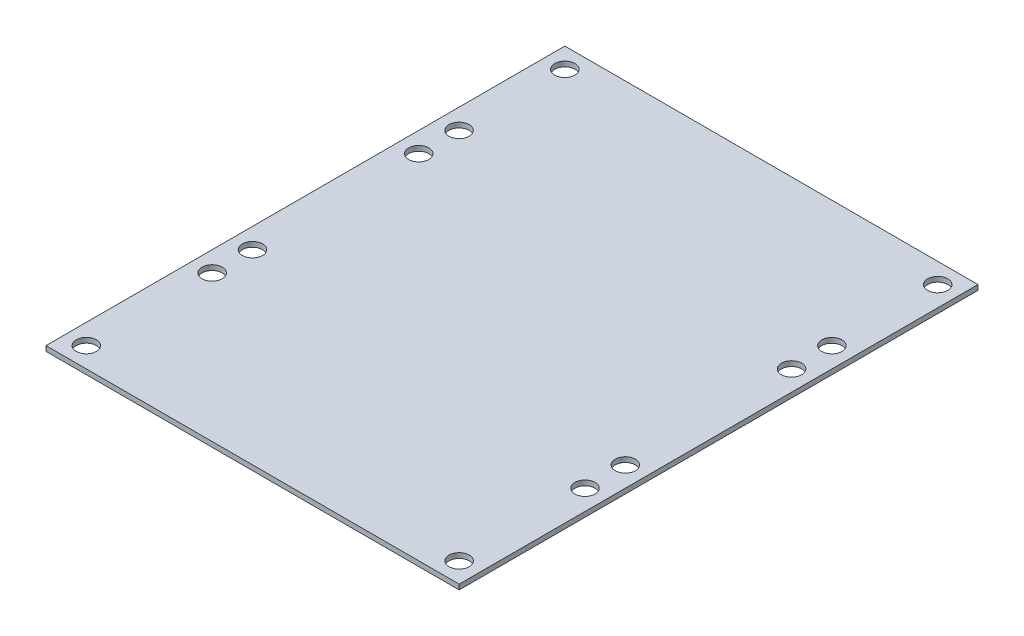
ISO-10303-21;
HEADER;
FILE_DESCRIPTION(('STEP AP214'),'2;1');
FILE_NAME('part.step','',(''),(''),'','','');
FILE_SCHEMA(('AUTOMOTIVE_DESIGN { 1 0 10303 214 1 1 1 1 }'));
ENDSEC;
DATA;
#1=APPLICATION_CONTEXT('core data for automotive mechanical design processes');
#2=APPLICATION_PROTOCOL_DEFINITION('international standard','automotive_design',2000,#1);
#3=PRODUCT_CONTEXT('',#1,'mechanical');
#4=PRODUCT('Part','Part','',(#3));
#5=PRODUCT_RELATED_PRODUCT_CATEGORY('part','',(#4));
#6=PRODUCT_DEFINITION_FORMATION('','',#4);
#7=PRODUCT_DEFINITION_CONTEXT('part definition',#1,'design');
#8=PRODUCT_DEFINITION('design','',#6,#7);
#9=PRODUCT_DEFINITION_SHAPE('','',#8);
#10=(LENGTH_UNIT() NAMED_UNIT(*) SI_UNIT(.MILLI.,.METRE.));
#11=(NAMED_UNIT(*) PLANE_ANGLE_UNIT() SI_UNIT($,.RADIAN.));
#12=(NAMED_UNIT(*) SI_UNIT($,.STERADIAN.) SOLID_ANGLE_UNIT());
#13=UNCERTAINTY_MEASURE_WITH_UNIT(LENGTH_MEASURE(1.E-05),#10,'distance_accuracy_value','');
#14=(GEOMETRIC_REPRESENTATION_CONTEXT(3) GLOBAL_UNCERTAINTY_ASSIGNED_CONTEXT((#13)) GLOBAL_UNIT_ASSIGNED_CONTEXT((#10,
#11,#12)) REPRESENTATION_CONTEXT('',''));
#15=CARTESIAN_POINT('',(0.,0.,0.));
#16=DIRECTION('',(0.,0.,1.));
#17=DIRECTION('',(1.,0.,0.));
#18=AXIS2_PLACEMENT_3D('',#15,#16,#17);
#19=CARTESIAN_POINT('',(0.,1.5875,0.));
#20=DIRECTION('',(0.,-1.,0.));
#21=DIRECTION('',(0.,0.,-1.));
#22=AXIS2_PLACEMENT_3D('',#19,#20,#21);
#23=PLANE('',#22);
#24=DIRECTION('',(0.,0.,1.));
#25=VECTOR('',#24,1.);
#26=CARTESIAN_POINT('',(0.,1.5875,0.));
#27=LINE('',#26,#25);
#28=CARTESIAN_POINT('',(0.,1.5875,-163.4744));
#29=VERTEX_POINT('',#28);
#30=CARTESIAN_POINT('',(0.,1.5875,0.));
#31=VERTEX_POINT('',#30);
#32=EDGE_CURVE('E92',#29,#31,#27,.T.);
#33=ORIENTED_EDGE('',*,*,#32,.T.);
#34=DIRECTION('',(1.,0.,0.));
#35=VECTOR('',#34,1.);
#36=CARTESIAN_POINT('',(0.,1.5875,0.));
#37=LINE('',#36,#35);
#38=CARTESIAN_POINT('',(130.175,1.5875,0.));
#39=VERTEX_POINT('',#38);
#40=EDGE_CURVE('E87',#31,#39,#37,.T.);
#41=ORIENTED_EDGE('',*,*,#40,.T.);
#42=DIRECTION('',(0.,0.,-1.));
#43=VECTOR('',#42,1.);
#44=CARTESIAN_POINT('',(130.175,1.5875,0.));
#45=LINE('',#44,#43);
#46=CARTESIAN_POINT('',(130.175,1.5875,-163.4744));
#47=VERTEX_POINT('',#46);
#48=EDGE_CURVE('E90',#39,#47,#45,.T.);
#49=ORIENTED_EDGE('',*,*,#48,.T.);
#50=DIRECTION('',(-1.,0.,0.));
#51=VECTOR('',#50,1.);
#52=CARTESIAN_POINT('',(0.,1.5875,-163.4744));
#53=LINE('',#52,#51);
#54=EDGE_CURVE('E57',#47,#29,#53,.T.);
#55=ORIENTED_EDGE('',*,*,#54,.T.);
#56=EDGE_LOOP('',(#33,#41,#49,#55));
#57=FACE_BOUND('',#56,.T.);
#58=CARTESIAN_POINT('',(6.35,1.5875,-6.35));
#59=DIRECTION('',(0.,1.,0.));
#60=DIRECTION('',(0.,0.,1.));
#61=AXIS2_PLACEMENT_3D('',#58,#59,#60);
#62=CIRCLE('',#61,3.175);
#63=CARTESIAN_POINT('',(6.35,1.5875,-3.175));
#64=VERTEX_POINT('',#63);
#65=EDGE_CURVE('E112',#64,#64,#62,.T.);
#66=ORIENTED_EDGE('',*,*,#65,.F.);
#67=EDGE_LOOP('',(#66));
#68=FACE_BOUND('',#67,.T.);
#69=CARTESIAN_POINT('',(6.35,1.5875,-157.1244));
#70=DIRECTION('',(0.,1.,0.));
#71=DIRECTION('',(0.,0.,1.));
#72=AXIS2_PLACEMENT_3D('',#69,#70,#71);
#73=CIRCLE('',#72,3.175);
#74=CARTESIAN_POINT('',(6.35,1.5875,-153.9494));
#75=VERTEX_POINT('',#74);
#76=EDGE_CURVE('E134',#75,#75,#73,.T.);
#77=ORIENTED_EDGE('',*,*,#76,.F.);
#78=EDGE_LOOP('',(#77));
#79=FACE_BOUND('',#78,.T.);
#80=CARTESIAN_POINT('',(6.35,1.5875,-123.7869));
#81=DIRECTION('',(0.,1.,0.));
#82=DIRECTION('',(0.,0.,1.));
#83=AXIS2_PLACEMENT_3D('',#80,#81,#82);
#84=CIRCLE('',#83,3.175);
#85=CARTESIAN_POINT('',(6.35,1.5875,-120.6119));
#86=VERTEX_POINT('',#85);
#87=EDGE_CURVE('E142',#86,#86,#84,.T.);
#88=ORIENTED_EDGE('',*,*,#87,.F.);
#89=EDGE_LOOP('',(#88));
#90=FACE_BOUND('',#89,.T.);
#91=CARTESIAN_POINT('',(123.825,1.5875,-6.35));
#92=DIRECTION('',(0.,1.,0.));
#93=DIRECTION('',(0.,0.,-1.));
#94=AXIS2_PLACEMENT_3D('',#91,#92,#93);
#95=CIRCLE('',#94,3.17499999999998);
#96=CARTESIAN_POINT('',(123.825,1.5875,-9.52499999999998));
#97=VERTEX_POINT('',#96);
#98=EDGE_CURVE('E150',#97,#97,#95,.T.);
#99=ORIENTED_EDGE('',*,*,#98,.F.);
#100=EDGE_LOOP('',(#99));
#101=FACE_BOUND('',#100,.T.);
#102=CARTESIAN_POINT('',(123.825,1.5875,-123.7869));
#103=DIRECTION('',(0.,1.,0.));
#104=DIRECTION('',(0.,0.,-1.));
#105=AXIS2_PLACEMENT_3D('',#102,#103,#104);
#106=CIRCLE('',#105,3.17500000000001);
#107=CARTESIAN_POINT('',(123.825,1.5875,-126.9619));
#108=VERTEX_POINT('',#107);
#109=EDGE_CURVE('E158',#108,#108,#106,.T.);
#110=ORIENTED_EDGE('',*,*,#109,.F.);
#111=EDGE_LOOP('',(#110));
#112=FACE_BOUND('',#111,.T.);
#113=CARTESIAN_POINT('',(6.35000000000001,1.5875,-111.0869));
#114=DIRECTION('',(0.,1.,0.));
#115=DIRECTION('',(0.,0.,1.));
#116=AXIS2_PLACEMENT_3D('',#113,#114,#115);
#117=CIRCLE('',#116,3.175);
#118=CARTESIAN_POINT('',(6.35000000000001,1.5875,-107.9119));
#119=VERTEX_POINT('',#118);
#120=EDGE_CURVE('E166',#119,#119,#117,.T.);
#121=ORIENTED_EDGE('',*,*,#120,.F.);
#122=EDGE_LOOP('',(#121));
#123=FACE_BOUND('',#122,.T.);
#124=CARTESIAN_POINT('',(123.825,1.5875,-157.1244));
#125=DIRECTION('',(0.,1.,0.));
#126=DIRECTION('',(0.,0.,-1.));
#127=AXIS2_PLACEMENT_3D('',#124,#125,#126);
#128=CIRCLE('',#127,3.17499999999998);
#129=CARTESIAN_POINT('',(123.825,1.5875,-160.2994));
#130=VERTEX_POINT('',#129);
#131=EDGE_CURVE('E174',#130,#130,#128,.T.);
#132=ORIENTED_EDGE('',*,*,#131,.F.);
#133=EDGE_LOOP('',(#132));
#134=FACE_BOUND('',#133,.T.);
#135=CARTESIAN_POINT('',(6.35000000000001,1.5875,-58.6994));
#136=DIRECTION('',(0.,1.,0.));
#137=DIRECTION('',(0.,0.,1.));
#138=AXIS2_PLACEMENT_3D('',#135,#136,#137);
#139=CIRCLE('',#138,3.175);
#140=CARTESIAN_POINT('',(6.35000000000001,1.5875,-55.5244));
#141=VERTEX_POINT('',#140);
#142=EDGE_CURVE('E182',#141,#141,#139,.T.);
#143=ORIENTED_EDGE('',*,*,#142,.F.);
#144=EDGE_LOOP('',(#143));
#145=FACE_BOUND('',#144,.T.);
#146=CARTESIAN_POINT('',(6.35000000000001,1.5875,-45.9994));
#147=DIRECTION('',(0.,1.,0.));
#148=DIRECTION('',(0.,0.,1.));
#149=AXIS2_PLACEMENT_3D('',#146,#147,#148);
#150=CIRCLE('',#149,3.175);
#151=CARTESIAN_POINT('',(6.35000000000001,1.5875,-42.8244));
#152=VERTEX_POINT('',#151);
#153=EDGE_CURVE('E190',#152,#152,#150,.T.);
#154=ORIENTED_EDGE('',*,*,#153,.F.);
#155=EDGE_LOOP('',(#154));
#156=FACE_BOUND('',#155,.T.);
#157=CARTESIAN_POINT('',(123.825,1.5875,-111.0869));
#158=DIRECTION('',(0.,1.,0.));
#159=DIRECTION('',(0.,0.,-1.));
#160=AXIS2_PLACEMENT_3D('',#157,#158,#159);
#161=CIRCLE('',#160,3.175);
#162=CARTESIAN_POINT('',(123.825,1.5875,-114.2619));
#163=VERTEX_POINT('',#162);
#164=EDGE_CURVE('E198',#163,#163,#161,.T.);
#165=ORIENTED_EDGE('',*,*,#164,.F.);
#166=EDGE_LOOP('',(#165));
#167=FACE_BOUND('',#166,.T.);
#168=CARTESIAN_POINT('',(123.825,1.5875,-58.6994));
#169=DIRECTION('',(0.,1.,0.));
#170=DIRECTION('',(0.,0.,-1.));
#171=AXIS2_PLACEMENT_3D('',#168,#169,#170);
#172=CIRCLE('',#171,3.175);
#173=CARTESIAN_POINT('',(123.825,1.5875,-61.8744));
#174=VERTEX_POINT('',#173);
#175=EDGE_CURVE('E206',#174,#174,#172,.T.);
#176=ORIENTED_EDGE('',*,*,#175,.F.);
#177=EDGE_LOOP('',(#176));
#178=FACE_BOUND('',#177,.T.);
#179=CARTESIAN_POINT('',(123.825,1.5875,-45.9994));
#180=DIRECTION('',(0.,1.,0.));
#181=DIRECTION('',(0.,0.,-1.));
#182=AXIS2_PLACEMENT_3D('',#179,#180,#181);
#183=CIRCLE('',#182,3.175);
#184=CARTESIAN_POINT('',(123.825,1.5875,-49.1744));
#185=VERTEX_POINT('',#184);
#186=EDGE_CURVE('E214',#185,#185,#183,.T.);
#187=ORIENTED_EDGE('',*,*,#186,.F.);
#188=EDGE_LOOP('',(#187));
#189=FACE_BOUND('',#188,.T.);
#190=ADVANCED_FACE('F39',(#57,#68,#79,#90,#101,#112,#123,#134,#145,#156,#167,#178,#189),#23,.F.);
#191=CARTESIAN_POINT('',(0.,0.,0.));
#192=DIRECTION('',(0.,-1.,0.));
#193=DIRECTION('',(0.,0.,-1.));
#194=AXIS2_PLACEMENT_3D('',#191,#192,#193);
#195=PLANE('',#194);
#196=CARTESIAN_POINT('',(123.825,0.,-58.6994));
#197=DIRECTION('',(0.,1.,0.));
#198=DIRECTION('',(0.,0.,-1.));
#199=AXIS2_PLACEMENT_3D('',#196,#197,#198);
#200=CIRCLE('',#199,3.175);
#201=CARTESIAN_POINT('',(123.825,0.,-61.8744));
#202=VERTEX_POINT('',#201);
#203=EDGE_CURVE('E210',#202,#202,#200,.T.);
#204=ORIENTED_EDGE('',*,*,#203,.T.);
#205=EDGE_LOOP('',(#204));
#206=FACE_BOUND('',#205,.T.);
#207=CARTESIAN_POINT('',(6.35000000000001,0.,-45.9994));
#208=DIRECTION('',(0.,1.,0.));
#209=DIRECTION('',(0.,0.,1.));
#210=AXIS2_PLACEMENT_3D('',#207,#208,#209);
#211=CIRCLE('',#210,3.175);
#212=CARTESIAN_POINT('',(6.35000000000001,0.,-42.8244));
#213=VERTEX_POINT('',#212);
#214=EDGE_CURVE('E194',#213,#213,#211,.T.);
#215=ORIENTED_EDGE('',*,*,#214,.T.);
#216=EDGE_LOOP('',(#215));
#217=FACE_BOUND('',#216,.T.);
#218=CARTESIAN_POINT('',(123.825,0.,-157.1244));
#219=DIRECTION('',(0.,1.,0.));
#220=DIRECTION('',(0.,0.,-1.));
#221=AXIS2_PLACEMENT_3D('',#218,#219,#220);
#222=CIRCLE('',#221,3.17499999999998);
#223=CARTESIAN_POINT('',(123.825,0.,-160.2994));
#224=VERTEX_POINT('',#223);
#225=EDGE_CURVE('E178',#224,#224,#222,.T.);
#226=ORIENTED_EDGE('',*,*,#225,.T.);
#227=EDGE_LOOP('',(#226));
#228=FACE_BOUND('',#227,.T.);
#229=CARTESIAN_POINT('',(123.825,0.,-123.7869));
#230=DIRECTION('',(0.,1.,0.));
#231=DIRECTION('',(0.,0.,-1.));
#232=AXIS2_PLACEMENT_3D('',#229,#230,#231);
#233=CIRCLE('',#232,3.17500000000001);
#234=CARTESIAN_POINT('',(123.825,0.,-126.9619));
#235=VERTEX_POINT('',#234);
#236=EDGE_CURVE('E162',#235,#235,#233,.T.);
#237=ORIENTED_EDGE('',*,*,#236,.T.);
#238=EDGE_LOOP('',(#237));
#239=FACE_BOUND('',#238,.T.);
#240=CARTESIAN_POINT('',(6.35,0.,-123.7869));
#241=DIRECTION('',(0.,1.,0.));
#242=DIRECTION('',(0.,0.,1.));
#243=AXIS2_PLACEMENT_3D('',#240,#241,#242);
#244=CIRCLE('',#243,3.175);
#245=CARTESIAN_POINT('',(6.35,0.,-120.6119));
#246=VERTEX_POINT('',#245);
#247=EDGE_CURVE('E146',#246,#246,#244,.T.);
#248=ORIENTED_EDGE('',*,*,#247,.T.);
#249=EDGE_LOOP('',(#248));
#250=FACE_BOUND('',#249,.T.);
#251=CARTESIAN_POINT('',(6.35,0.,-6.35));
#252=DIRECTION('',(0.,1.,0.));
#253=DIRECTION('',(0.,0.,1.));
#254=AXIS2_PLACEMENT_3D('',#251,#252,#253);
#255=CIRCLE('',#254,3.175);
#256=CARTESIAN_POINT('',(6.35,0.,-3.175));
#257=VERTEX_POINT('',#256);
#258=EDGE_CURVE('E130',#257,#257,#255,.T.);
#259=ORIENTED_EDGE('',*,*,#258,.T.);
#260=EDGE_LOOP('',(#259));
#261=FACE_BOUND('',#260,.T.);
#262=DIRECTION('',(0.,0.,1.));
#263=VECTOR('',#262,1.);
#264=CARTESIAN_POINT('',(0.,0.,0.));
#265=LINE('',#264,#263);
#266=CARTESIAN_POINT('',(0.,0.,-163.4744));
#267=VERTEX_POINT('',#266);
#268=CARTESIAN_POINT('',(0.,0.,0.));
#269=VERTEX_POINT('',#268);
#270=EDGE_CURVE('E108',#267,#269,#265,.T.);
#271=ORIENTED_EDGE('',*,*,#270,.F.);
#272=DIRECTION('',(-1.,0.,0.));
#273=VECTOR('',#272,1.);
#274=CARTESIAN_POINT('',(0.,0.,-163.4744));
#275=LINE('',#274,#273);
#276=CARTESIAN_POINT('',(130.175,0.,-163.4744));
#277=VERTEX_POINT('',#276);
#278=EDGE_CURVE('E80',#277,#267,#275,.T.);
#279=ORIENTED_EDGE('',*,*,#278,.F.);
#280=DIRECTION('',(0.,0.,-1.));
#281=VECTOR('',#280,1.);
#282=CARTESIAN_POINT('',(130.175,0.,0.));
#283=LINE('',#282,#281);
#284=CARTESIAN_POINT('',(130.175,0.,0.));
#285=VERTEX_POINT('',#284);
#286=EDGE_CURVE('E74',#285,#277,#283,.T.);
#287=ORIENTED_EDGE('',*,*,#286,.F.);
#288=DIRECTION('',(1.,0.,0.));
#289=VECTOR('',#288,1.);
#290=CARTESIAN_POINT('',(0.,0.,0.));
#291=LINE('',#290,#289);
#292=EDGE_CURVE('E97',#269,#285,#291,.T.);
#293=ORIENTED_EDGE('',*,*,#292,.F.);
#294=EDGE_LOOP('',(#271,#279,#287,#293));
#295=FACE_BOUND('',#294,.T.);
#296=CARTESIAN_POINT('',(6.35,0.,-157.1244));
#297=DIRECTION('',(0.,1.,0.));
#298=DIRECTION('',(0.,0.,1.));
#299=AXIS2_PLACEMENT_3D('',#296,#297,#298);
#300=CIRCLE('',#299,3.175);
#301=CARTESIAN_POINT('',(6.35,0.,-153.9494));
#302=VERTEX_POINT('',#301);
#303=EDGE_CURVE('E138',#302,#302,#300,.T.);
#304=ORIENTED_EDGE('',*,*,#303,.T.);
#305=EDGE_LOOP('',(#304));
#306=FACE_BOUND('',#305,.T.);
#307=CARTESIAN_POINT('',(123.825,0.,-6.35));
#308=DIRECTION('',(0.,1.,0.));
#309=DIRECTION('',(0.,0.,-1.));
#310=AXIS2_PLACEMENT_3D('',#307,#308,#309);
#311=CIRCLE('',#310,3.17499999999998);
#312=CARTESIAN_POINT('',(123.825,0.,-9.52499999999998));
#313=VERTEX_POINT('',#312);
#314=EDGE_CURVE('E154',#313,#313,#311,.T.);
#315=ORIENTED_EDGE('',*,*,#314,.T.);
#316=EDGE_LOOP('',(#315));
#317=FACE_BOUND('',#316,.T.);
#318=CARTESIAN_POINT('',(6.35000000000001,0.,-111.0869));
#319=DIRECTION('',(0.,1.,0.));
#320=DIRECTION('',(0.,0.,1.));
#321=AXIS2_PLACEMENT_3D('',#318,#319,#320);
#322=CIRCLE('',#321,3.175);
#323=CARTESIAN_POINT('',(6.35000000000001,0.,-107.9119));
#324=VERTEX_POINT('',#323);
#325=EDGE_CURVE('E170',#324,#324,#322,.T.);
#326=ORIENTED_EDGE('',*,*,#325,.T.);
#327=EDGE_LOOP('',(#326));
#328=FACE_BOUND('',#327,.T.);
#329=CARTESIAN_POINT('',(6.35000000000001,0.,-58.6994));
#330=DIRECTION('',(0.,1.,0.));
#331=DIRECTION('',(0.,0.,1.));
#332=AXIS2_PLACEMENT_3D('',#329,#330,#331);
#333=CIRCLE('',#332,3.175);
#334=CARTESIAN_POINT('',(6.35000000000001,0.,-55.5244));
#335=VERTEX_POINT('',#334);
#336=EDGE_CURVE('E186',#335,#335,#333,.T.);
#337=ORIENTED_EDGE('',*,*,#336,.T.);
#338=EDGE_LOOP('',(#337));
#339=FACE_BOUND('',#338,.T.);
#340=CARTESIAN_POINT('',(123.825,0.,-111.0869));
#341=DIRECTION('',(0.,1.,0.));
#342=DIRECTION('',(0.,0.,-1.));
#343=AXIS2_PLACEMENT_3D('',#340,#341,#342);
#344=CIRCLE('',#343,3.175);
#345=CARTESIAN_POINT('',(123.825,0.,-114.2619));
#346=VERTEX_POINT('',#345);
#347=EDGE_CURVE('E202',#346,#346,#344,.T.);
#348=ORIENTED_EDGE('',*,*,#347,.T.);
#349=EDGE_LOOP('',(#348));
#350=FACE_BOUND('',#349,.T.);
#351=CARTESIAN_POINT('',(123.825,0.,-45.9994));
#352=DIRECTION('',(0.,1.,0.));
#353=DIRECTION('',(0.,0.,-1.));
#354=AXIS2_PLACEMENT_3D('',#351,#352,#353);
#355=CIRCLE('',#354,3.175);
#356=CARTESIAN_POINT('',(123.825,0.,-49.1744));
#357=VERTEX_POINT('',#356);
#358=EDGE_CURVE('E218',#357,#357,#355,.T.);
#359=ORIENTED_EDGE('',*,*,#358,.T.);
#360=EDGE_LOOP('',(#359));
#361=FACE_BOUND('',#360,.T.);
#362=ADVANCED_FACE('F125',(#206,#217,#228,#239,#250,#261,#295,#306,#317,#328,#339,#350,#361),
#195,.T.);
#363=CARTESIAN_POINT('',(0.,1.5875,0.));
#364=DIRECTION('',(1.,0.,0.));
#365=DIRECTION('',(0.,0.,-1.));
#366=AXIS2_PLACEMENT_3D('',#363,#364,#365);
#367=PLANE('',#366);
#368=ORIENTED_EDGE('',*,*,#270,.T.);
#369=DIRECTION('',(0.,-1.,0.));
#370=VECTOR('',#369,1.);
#371=CARTESIAN_POINT('',(0.,1.5875,0.));
#372=LINE('',#371,#370);
#373=EDGE_CURVE('E11',#31,#269,#372,.T.);
#374=ORIENTED_EDGE('',*,*,#373,.F.);
#375=ORIENTED_EDGE('',*,*,#32,.F.);
#376=DIRECTION('',(0.,-1.,0.));
#377=VECTOR('',#376,1.);
#378=CARTESIAN_POINT('',(0.,1.5875,-163.4744));
#379=LINE('',#378,#377);
#380=EDGE_CURVE('E104',#29,#267,#379,.T.);
#381=ORIENTED_EDGE('',*,*,#380,.T.);
#382=EDGE_LOOP('',(#368,#374,#375,#381));
#383=FACE_BOUND('',#382,.T.);
#384=ADVANCED_FACE('F41',(#383),#367,.F.);
#385=CARTESIAN_POINT('',(0.,1.5875,0.));
#386=DIRECTION('',(0.,0.,-1.));
#387=DIRECTION('',(-1.,0.,0.));
#388=AXIS2_PLACEMENT_3D('',#385,#386,#387);
#389=PLANE('',#388);
#390=ORIENTED_EDGE('',*,*,#292,.T.);
#391=DIRECTION('',(0.,-1.,0.));
#392=VECTOR('',#391,1.);
#393=CARTESIAN_POINT('',(130.175,1.5875,0.));
#394=LINE('',#393,#392);
#395=EDGE_CURVE('E49',#39,#285,#394,.T.);
#396=ORIENTED_EDGE('',*,*,#395,.F.);
#397=ORIENTED_EDGE('',*,*,#40,.F.);
#398=ORIENTED_EDGE('',*,*,#373,.T.);
#399=EDGE_LOOP('',(#390,#396,#397,#398));
#400=FACE_BOUND('',#399,.T.);
#401=ADVANCED_FACE('F96',(#400),#389,.F.);
#402=CARTESIAN_POINT('',(130.175,1.5875,0.));
#403=DIRECTION('',(-1.,0.,0.));
#404=DIRECTION('',(0.,0.,1.));
#405=AXIS2_PLACEMENT_3D('',#402,#403,#404);
#406=PLANE('',#405);
#407=ORIENTED_EDGE('',*,*,#286,.T.);
#408=DIRECTION('',(0.,-1.,0.));
#409=VECTOR('',#408,1.);
#410=CARTESIAN_POINT('',(130.175,1.5875,-163.4744));
#411=LINE('',#410,#409);
#412=EDGE_CURVE('E99',#47,#277,#411,.T.);
#413=ORIENTED_EDGE('',*,*,#412,.F.);
#414=ORIENTED_EDGE('',*,*,#48,.F.);
#415=ORIENTED_EDGE('',*,*,#395,.T.);
#416=EDGE_LOOP('',(#407,#413,#414,#415));
#417=FACE_BOUND('',#416,.T.);
#418=ADVANCED_FACE('F100',(#417),#406,.F.);
#419=CARTESIAN_POINT('',(0.,1.5875,-163.4744));
#420=DIRECTION('',(0.,0.,1.));
#421=DIRECTION('',(1.,0.,0.));
#422=AXIS2_PLACEMENT_3D('',#419,#420,#421);
#423=PLANE('',#422);
#424=ORIENTED_EDGE('',*,*,#278,.T.);
#425=ORIENTED_EDGE('',*,*,#380,.F.);
#426=ORIENTED_EDGE('',*,*,#54,.F.);
#427=ORIENTED_EDGE('',*,*,#412,.T.);
#428=EDGE_LOOP('',(#424,#425,#426,#427));
#429=FACE_BOUND('',#428,.T.);
#430=ADVANCED_FACE('F122',(#429),#423,.F.);
#431=CARTESIAN_POINT('',(6.35,1.5875,-6.35));
#432=DIRECTION('',(0.,-1.,0.));
#433=DIRECTION('',(0.,0.,-1.));
#434=AXIS2_PLACEMENT_3D('',#431,#432,#433);
#435=CYLINDRICAL_SURFACE('',#434,3.175);
#436=ORIENTED_EDGE('',*,*,#65,.T.);
#437=EDGE_LOOP('',(#436));
#438=FACE_BOUND('',#437,.T.);
#439=ORIENTED_EDGE('',*,*,#258,.F.);
#440=EDGE_LOOP('',(#439));
#441=FACE_BOUND('',#440,.T.);
#442=ADVANCED_FACE('F237',(#438,#441),#435,.F.);
#443=CARTESIAN_POINT('',(6.35,1.5875,-157.1244));
#444=DIRECTION('',(0.,-1.,0.));
#445=DIRECTION('',(0.,0.,-1.));
#446=AXIS2_PLACEMENT_3D('',#443,#444,#445);
#447=CYLINDRICAL_SURFACE('',#446,3.175);
#448=ORIENTED_EDGE('',*,*,#76,.T.);
#449=EDGE_LOOP('',(#448));
#450=FACE_BOUND('',#449,.T.);
#451=ORIENTED_EDGE('',*,*,#303,.F.);
#452=EDGE_LOOP('',(#451));
#453=FACE_BOUND('',#452,.T.);
#454=ADVANCED_FACE('F283',(#450,#453),#447,.F.);
#455=CARTESIAN_POINT('',(6.35,1.5875,-123.7869));
#456=DIRECTION('',(0.,-1.,0.));
#457=DIRECTION('',(0.,0.,-1.));
#458=AXIS2_PLACEMENT_3D('',#455,#456,#457);
#459=CYLINDRICAL_SURFACE('',#458,3.175);
#460=ORIENTED_EDGE('',*,*,#87,.T.);
#461=EDGE_LOOP('',(#460));
#462=FACE_BOUND('',#461,.T.);
#463=ORIENTED_EDGE('',*,*,#247,.F.);
#464=EDGE_LOOP('',(#463));
#465=FACE_BOUND('',#464,.T.);
#466=ADVANCED_FACE('F291',(#462,#465),#459,.F.);
#467=CARTESIAN_POINT('',(123.825,1.5875,-6.35));
#468=DIRECTION('',(0.,-1.,0.));
#469=DIRECTION('',(0.,0.,-1.));
#470=AXIS2_PLACEMENT_3D('',#467,#468,#469);
#471=CYLINDRICAL_SURFACE('',#470,3.17499999999998);
#472=ORIENTED_EDGE('',*,*,#98,.T.);
#473=EDGE_LOOP('',(#472));
#474=FACE_BOUND('',#473,.T.);
#475=ORIENTED_EDGE('',*,*,#314,.F.);
#476=EDGE_LOOP('',(#475));
#477=FACE_BOUND('',#476,.T.);
#478=ADVANCED_FACE('F299',(#474,#477),#471,.F.);
#479=CARTESIAN_POINT('',(123.825,1.5875,-123.7869));
#480=DIRECTION('',(0.,-1.,0.));
#481=DIRECTION('',(0.,0.,-1.));
#482=AXIS2_PLACEMENT_3D('',#479,#480,#481);
#483=CYLINDRICAL_SURFACE('',#482,3.17500000000001);
#484=ORIENTED_EDGE('',*,*,#109,.T.);
#485=EDGE_LOOP('',(#484));
#486=FACE_BOUND('',#485,.T.);
#487=ORIENTED_EDGE('',*,*,#236,.F.);
#488=EDGE_LOOP('',(#487));
#489=FACE_BOUND('',#488,.T.);
#490=ADVANCED_FACE('F308',(#486,#489),#483,.F.);
#491=CARTESIAN_POINT('',(6.35000000000001,1.5875,-111.0869));
#492=DIRECTION('',(0.,-1.,0.));
#493=DIRECTION('',(0.,0.,-1.));
#494=AXIS2_PLACEMENT_3D('',#491,#492,#493);
#495=CYLINDRICAL_SURFACE('',#494,3.175);
#496=ORIENTED_EDGE('',*,*,#120,.T.);
#497=EDGE_LOOP('',(#496));
#498=FACE_BOUND('',#497,.T.);
#499=ORIENTED_EDGE('',*,*,#325,.F.);
#500=EDGE_LOOP('',(#499));
#501=FACE_BOUND('',#500,.T.);
#502=ADVANCED_FACE('F317',(#498,#501),#495,.F.);
#503=CARTESIAN_POINT('',(123.825,1.5875,-157.1244));
#504=DIRECTION('',(0.,-1.,0.));
#505=DIRECTION('',(0.,0.,-1.));
#506=AXIS2_PLACEMENT_3D('',#503,#504,#505);
#507=CYLINDRICAL_SURFACE('',#506,3.17499999999998);
#508=ORIENTED_EDGE('',*,*,#131,.T.);
#509=EDGE_LOOP('',(#508));
#510=FACE_BOUND('',#509,.T.);
#511=ORIENTED_EDGE('',*,*,#225,.F.);
#512=EDGE_LOOP('',(#511));
#513=FACE_BOUND('',#512,.T.);
#514=ADVANCED_FACE('F326',(#510,#513),#507,.F.);
#515=CARTESIAN_POINT('',(6.35000000000001,1.5875,-58.6994));
#516=DIRECTION('',(0.,-1.,0.));
#517=DIRECTION('',(0.,0.,-1.));
#518=AXIS2_PLACEMENT_3D('',#515,#516,#517);
#519=CYLINDRICAL_SURFACE('',#518,3.175);
#520=ORIENTED_EDGE('',*,*,#142,.T.);
#521=EDGE_LOOP('',(#520));
#522=FACE_BOUND('',#521,.T.);
#523=ORIENTED_EDGE('',*,*,#336,.F.);
#524=EDGE_LOOP('',(#523));
#525=FACE_BOUND('',#524,.T.);
#526=ADVANCED_FACE('F335',(#522,#525),#519,.F.);
#527=CARTESIAN_POINT('',(6.35000000000001,1.5875,-45.9994));
#528=DIRECTION('',(0.,-1.,0.));
#529=DIRECTION('',(0.,0.,-1.));
#530=AXIS2_PLACEMENT_3D('',#527,#528,#529);
#531=CYLINDRICAL_SURFACE('',#530,3.175);
#532=ORIENTED_EDGE('',*,*,#153,.T.);
#533=EDGE_LOOP('',(#532));
#534=FACE_BOUND('',#533,.T.);
#535=ORIENTED_EDGE('',*,*,#214,.F.);
#536=EDGE_LOOP('',(#535));
#537=FACE_BOUND('',#536,.T.);
#538=ADVANCED_FACE('F344',(#534,#537),#531,.F.);
#539=CARTESIAN_POINT('',(123.825,1.5875,-111.0869));
#540=DIRECTION('',(0.,-1.,0.));
#541=DIRECTION('',(0.,0.,-1.));
#542=AXIS2_PLACEMENT_3D('',#539,#540,#541);
#543=CYLINDRICAL_SURFACE('',#542,3.175);
#544=ORIENTED_EDGE('',*,*,#164,.T.);
#545=EDGE_LOOP('',(#544));
#546=FACE_BOUND('',#545,.T.);
#547=ORIENTED_EDGE('',*,*,#347,.F.);
#548=EDGE_LOOP('',(#547));
#549=FACE_BOUND('',#548,.T.);
#550=ADVANCED_FACE('F353',(#546,#549),#543,.F.);
#551=CARTESIAN_POINT('',(123.825,1.5875,-58.6994));
#552=DIRECTION('',(0.,-1.,0.));
#553=DIRECTION('',(0.,0.,-1.));
#554=AXIS2_PLACEMENT_3D('',#551,#552,#553);
#555=CYLINDRICAL_SURFACE('',#554,3.175);
#556=ORIENTED_EDGE('',*,*,#175,.T.);
#557=EDGE_LOOP('',(#556));
#558=FACE_BOUND('',#557,.T.);
#559=ORIENTED_EDGE('',*,*,#203,.F.);
#560=EDGE_LOOP('',(#559));
#561=FACE_BOUND('',#560,.T.);
#562=ADVANCED_FACE('F362',(#558,#561),#555,.F.);
#563=CARTESIAN_POINT('',(123.825,1.5875,-45.9994));
#564=DIRECTION('',(0.,-1.,0.));
#565=DIRECTION('',(0.,0.,-1.));
#566=AXIS2_PLACEMENT_3D('',#563,#564,#565);
#567=CYLINDRICAL_SURFACE('',#566,3.175);
#568=ORIENTED_EDGE('',*,*,#186,.T.);
#569=EDGE_LOOP('',(#568));
#570=FACE_BOUND('',#569,.T.);
#571=ORIENTED_EDGE('',*,*,#358,.F.);
#572=EDGE_LOOP('',(#571));
#573=FACE_BOUND('',#572,.T.);
#574=ADVANCED_FACE('F226',(#570,#573),#567,.F.);
#575=CLOSED_SHELL('',(#190,#362,#384,#401,#418,#430,#442,#454,#466,#478,#490,#502,#514,#526,
#538,#550,#562,#574));
#576=MANIFOLD_SOLID_BREP('B2',#575);
#577=ADVANCED_BREP_SHAPE_REPRESENTATION('',(#18,#576),#14);
#578=SHAPE_DEFINITION_REPRESENTATION(#9,#577);
ENDSEC;
END-ISO-10303-21;
